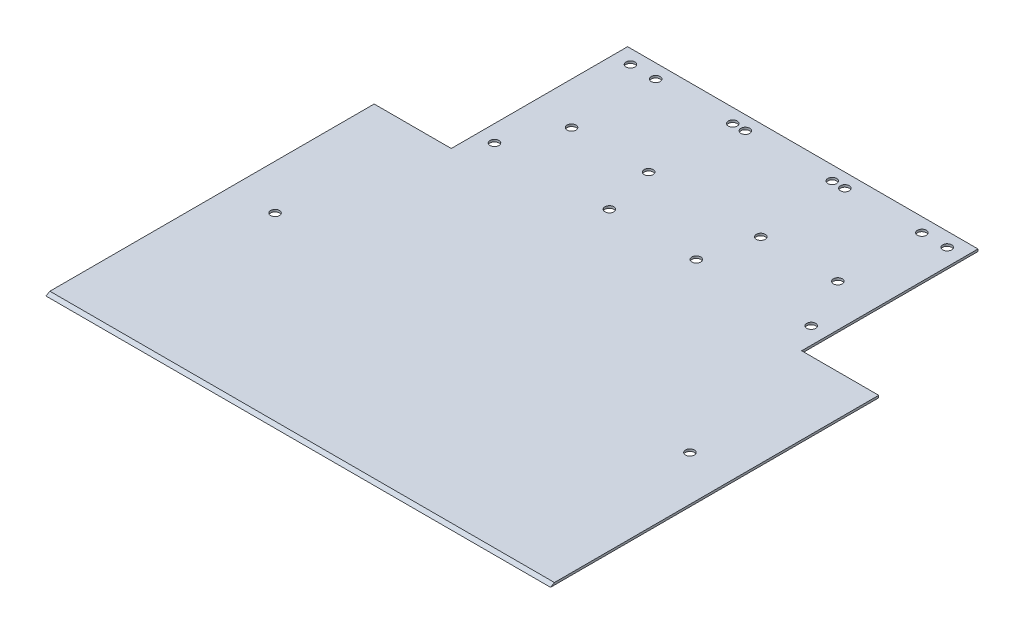
ISO-10303-21;
HEADER;
FILE_DESCRIPTION(('STEP AP214'),'2;1');
FILE_NAME('part.step','',(''),(''),'','','');
FILE_SCHEMA(('AUTOMOTIVE_DESIGN { 1 0 10303 214 1 1 1 1 }'));
ENDSEC;
DATA;
#1=APPLICATION_CONTEXT('core data for automotive mechanical design processes');
#2=APPLICATION_PROTOCOL_DEFINITION('international standard','automotive_design',2000,#1);
#3=PRODUCT_CONTEXT('',#1,'mechanical');
#4=PRODUCT('Part','Part','',(#3));
#5=PRODUCT_RELATED_PRODUCT_CATEGORY('part','',(#4));
#6=PRODUCT_DEFINITION_FORMATION('','',#4);
#7=PRODUCT_DEFINITION_CONTEXT('part definition',#1,'design');
#8=PRODUCT_DEFINITION('design','',#6,#7);
#9=PRODUCT_DEFINITION_SHAPE('','',#8);
#10=(LENGTH_UNIT() NAMED_UNIT(*) SI_UNIT(.MILLI.,.METRE.));
#11=(NAMED_UNIT(*) PLANE_ANGLE_UNIT() SI_UNIT($,.RADIAN.));
#12=(NAMED_UNIT(*) SI_UNIT($,.STERADIAN.) SOLID_ANGLE_UNIT());
#13=UNCERTAINTY_MEASURE_WITH_UNIT(LENGTH_MEASURE(1.E-05),#10,'distance_accuracy_value','');
#14=(GEOMETRIC_REPRESENTATION_CONTEXT(3) GLOBAL_UNCERTAINTY_ASSIGNED_CONTEXT((#13)) GLOBAL_UNIT_ASSIGNED_CONTEXT((#10,
#11,#12)) REPRESENTATION_CONTEXT('',''));
#15=CARTESIAN_POINT('',(0.,0.,0.));
#16=DIRECTION('',(0.,0.,1.));
#17=DIRECTION('',(1.,0.,0.));
#18=AXIS2_PLACEMENT_3D('',#15,#16,#17);
#19=CARTESIAN_POINT('',(90.,0.8,90.));
#20=DIRECTION('',(-1.,0.,0.));
#21=DIRECTION('',(0.,0.,1.));
#22=AXIS2_PLACEMENT_3D('',#19,#20,#21);
#23=PLANE('',#22);
#24=DIRECTION('',(0.,0.,-1.));
#25=VECTOR('',#24,1.);
#26=CARTESIAN_POINT('',(90.,0.8,90.));
#27=LINE('',#26,#25);
#28=CARTESIAN_POINT('',(90.,0.8,88.614359353945));
#29=VERTEX_POINT('',#28);
#30=CARTESIAN_POINT('',(90.,0.8,-27.08));
#31=VERTEX_POINT('',#30);
#32=EDGE_CURVE('E106',#29,#31,#27,.T.);
#33=ORIENTED_EDGE('',*,*,#32,.F.);
#34=DIRECTION('',(0.,0.500000000000006,-0.866025403784435));
#35=VECTOR('',#34,1.);
#36=CARTESIAN_POINT('',(90.,0.,90.0000000000001));
#37=LINE('',#36,#35);
#38=CARTESIAN_POINT('',(90.,0.,90.0000000000001));
#39=VERTEX_POINT('',#38);
#40=EDGE_CURVE('E183',#39,#29,#37,.T.);
#41=ORIENTED_EDGE('',*,*,#40,.F.);
#42=DIRECTION('',(0.,0.,-1.));
#43=VECTOR('',#42,1.);
#44=CARTESIAN_POINT('',(90.,0.,90.));
#45=LINE('',#44,#43);
#46=CARTESIAN_POINT('',(90.,0.,-27.08));
#47=VERTEX_POINT('',#46);
#48=EDGE_CURVE('E146',#39,#47,#45,.T.);
#49=ORIENTED_EDGE('',*,*,#48,.T.);
#50=DIRECTION('',(0.,-1.,0.));
#51=VECTOR('',#50,1.);
#52=CARTESIAN_POINT('',(90.,0.8,-27.08));
#53=LINE('',#52,#51);
#54=EDGE_CURVE('E11',#31,#47,#53,.T.);
#55=ORIENTED_EDGE('',*,*,#54,.F.);
#56=EDGE_LOOP('',(#33,#41,#49,#55));
#57=FACE_BOUND('',#56,.T.);
#58=ADVANCED_FACE('F48',(#57),#23,.F.);
#59=CARTESIAN_POINT('',(62.5,0.8,-27.08));
#60=DIRECTION('',(0.,0.,1.));
#61=DIRECTION('',(1.,0.,0.));
#62=AXIS2_PLACEMENT_3D('',#59,#60,#61);
#63=PLANE('',#62);
#64=DIRECTION('',(-1.,0.,0.));
#65=VECTOR('',#64,1.);
#66=CARTESIAN_POINT('',(62.5,0.,-27.08));
#67=LINE('',#66,#65);
#68=CARTESIAN_POINT('',(62.5,0.,-27.08));
#69=VERTEX_POINT('',#68);
#70=EDGE_CURVE('E149',#47,#69,#67,.T.);
#71=ORIENTED_EDGE('',*,*,#70,.T.);
#72=DIRECTION('',(0.,-1.,0.));
#73=VECTOR('',#72,1.);
#74=CARTESIAN_POINT('',(62.5,0.8,-27.08));
#75=LINE('',#74,#73);
#76=CARTESIAN_POINT('',(62.5,0.8,-27.08));
#77=VERTEX_POINT('',#76);
#78=EDGE_CURVE('E56',#77,#69,#75,.T.);
#79=ORIENTED_EDGE('',*,*,#78,.F.);
#80=DIRECTION('',(-1.,0.,0.));
#81=VECTOR('',#80,1.);
#82=CARTESIAN_POINT('',(62.5,0.8,-27.08));
#83=LINE('',#82,#81);
#84=EDGE_CURVE('E198',#31,#77,#83,.T.);
#85=ORIENTED_EDGE('',*,*,#84,.F.);
#86=ORIENTED_EDGE('',*,*,#54,.T.);
#87=EDGE_LOOP('',(#71,#79,#85,#86));
#88=FACE_BOUND('',#87,.T.);
#89=ADVANCED_FACE('F199',(#88),#63,.F.);
#90=CARTESIAN_POINT('',(62.5,0.8,-90.));
#91=DIRECTION('',(-1.,0.,0.));
#92=DIRECTION('',(0.,0.,1.));
#93=AXIS2_PLACEMENT_3D('',#90,#91,#92);
#94=PLANE('',#93);
#95=DIRECTION('',(0.,0.,-1.));
#96=VECTOR('',#95,1.);
#97=CARTESIAN_POINT('',(62.5,0.,-90.));
#98=LINE('',#97,#96);
#99=CARTESIAN_POINT('',(62.5,0.,-90.));
#100=VERTEX_POINT('',#99);
#101=EDGE_CURVE('E152',#69,#100,#98,.T.);
#102=ORIENTED_EDGE('',*,*,#101,.T.);
#103=DIRECTION('',(0.,-1.,0.));
#104=VECTOR('',#103,1.);
#105=CARTESIAN_POINT('',(62.5,0.8,-90.));
#106=LINE('',#105,#104);
#107=CARTESIAN_POINT('',(62.5,0.8,-90.));
#108=VERTEX_POINT('',#107);
#109=EDGE_CURVE('E135',#108,#100,#106,.T.);
#110=ORIENTED_EDGE('',*,*,#109,.F.);
#111=DIRECTION('',(0.,0.,-1.));
#112=VECTOR('',#111,1.);
#113=CARTESIAN_POINT('',(62.5,0.8,-90.));
#114=LINE('',#113,#112);
#115=EDGE_CURVE('E123',#77,#108,#114,.T.);
#116=ORIENTED_EDGE('',*,*,#115,.F.);
#117=ORIENTED_EDGE('',*,*,#78,.T.);
#118=EDGE_LOOP('',(#102,#110,#116,#117));
#119=FACE_BOUND('',#118,.T.);
#120=ADVANCED_FACE('F168',(#119),#94,.F.);
#121=CARTESIAN_POINT('',(62.5,0.8,-90.));
#122=DIRECTION('',(0.,0.,1.));
#123=DIRECTION('',(1.,0.,0.));
#124=AXIS2_PLACEMENT_3D('',#121,#122,#123);
#125=PLANE('',#124);
#126=DIRECTION('',(-1.,0.,0.));
#127=VECTOR('',#126,1.);
#128=CARTESIAN_POINT('',(62.5,0.,-90.));
#129=LINE('',#128,#127);
#130=CARTESIAN_POINT('',(-62.5,0.,-90.));
#131=VERTEX_POINT('',#130);
#132=EDGE_CURVE('E132',#100,#131,#129,.T.);
#133=ORIENTED_EDGE('',*,*,#132,.T.);
#134=DIRECTION('',(0.,-1.,0.));
#135=VECTOR('',#134,1.);
#136=CARTESIAN_POINT('',(-62.5,0.8,-90.));
#137=LINE('',#136,#135);
#138=CARTESIAN_POINT('',(-62.5,0.8,-90.));
#139=VERTEX_POINT('',#138);
#140=EDGE_CURVE('E129',#139,#131,#137,.T.);
#141=ORIENTED_EDGE('',*,*,#140,.F.);
#142=DIRECTION('',(-1.,0.,0.));
#143=VECTOR('',#142,1.);
#144=CARTESIAN_POINT('',(62.5,0.8,-90.));
#145=LINE('',#144,#143);
#146=EDGE_CURVE('E116',#108,#139,#145,.T.);
#147=ORIENTED_EDGE('',*,*,#146,.F.);
#148=ORIENTED_EDGE('',*,*,#109,.T.);
#149=EDGE_LOOP('',(#133,#141,#147,#148));
#150=FACE_BOUND('',#149,.T.);
#151=ADVANCED_FACE('F130',(#150),#125,.F.);
#152=CARTESIAN_POINT('',(-62.5,0.8,-90.));
#153=DIRECTION('',(1.,0.,0.));
#154=DIRECTION('',(0.,0.,-1.));
#155=AXIS2_PLACEMENT_3D('',#152,#153,#154);
#156=PLANE('',#155);
#157=DIRECTION('',(0.,0.,1.));
#158=VECTOR('',#157,1.);
#159=CARTESIAN_POINT('',(-62.5,0.,-90.));
#160=LINE('',#159,#158);
#161=CARTESIAN_POINT('',(-62.5,0.,-27.08));
#162=VERTEX_POINT('',#161);
#163=EDGE_CURVE('E155',#131,#162,#160,.T.);
#164=ORIENTED_EDGE('',*,*,#163,.T.);
#165=DIRECTION('',(0.,-1.,0.));
#166=VECTOR('',#165,1.);
#167=CARTESIAN_POINT('',(-62.5,0.8,-27.08));
#168=LINE('',#167,#166);
#169=CARTESIAN_POINT('',(-62.5,0.8,-27.08));
#170=VERTEX_POINT('',#169);
#171=EDGE_CURVE('E136',#170,#162,#168,.T.);
#172=ORIENTED_EDGE('',*,*,#171,.F.);
#173=DIRECTION('',(0.,0.,1.));
#174=VECTOR('',#173,1.);
#175=CARTESIAN_POINT('',(-62.5,0.8,-90.));
#176=LINE('',#175,#174);
#177=EDGE_CURVE('E120',#139,#170,#176,.T.);
#178=ORIENTED_EDGE('',*,*,#177,.F.);
#179=ORIENTED_EDGE('',*,*,#140,.T.);
#180=EDGE_LOOP('',(#164,#172,#178,#179));
#181=FACE_BOUND('',#180,.T.);
#182=ADVANCED_FACE('F138',(#181),#156,.F.);
#183=CARTESIAN_POINT('',(-62.5,0.8,-27.08));
#184=DIRECTION('',(0.,0.,1.));
#185=DIRECTION('',(1.,0.,0.));
#186=AXIS2_PLACEMENT_3D('',#183,#184,#185);
#187=PLANE('',#186);
#188=DIRECTION('',(-1.,0.,0.));
#189=VECTOR('',#188,1.);
#190=CARTESIAN_POINT('',(-62.5,0.,-27.08));
#191=LINE('',#190,#189);
#192=CARTESIAN_POINT('',(-90.,0.,-27.08));
#193=VERTEX_POINT('',#192);
#194=EDGE_CURVE('E90',#162,#193,#191,.T.);
#195=ORIENTED_EDGE('',*,*,#194,.T.);
#196=DIRECTION('',(0.,-1.,0.));
#197=VECTOR('',#196,1.);
#198=CARTESIAN_POINT('',(-90.,0.8,-27.08));
#199=LINE('',#198,#197);
#200=CARTESIAN_POINT('',(-90.,0.8,-27.08));
#201=VERTEX_POINT('',#200);
#202=EDGE_CURVE('E145',#201,#193,#199,.T.);
#203=ORIENTED_EDGE('',*,*,#202,.F.);
#204=DIRECTION('',(-1.,0.,0.));
#205=VECTOR('',#204,1.);
#206=CARTESIAN_POINT('',(-62.5,0.8,-27.08));
#207=LINE('',#206,#205);
#208=EDGE_CURVE('E64',#170,#201,#207,.T.);
#209=ORIENTED_EDGE('',*,*,#208,.F.);
#210=ORIENTED_EDGE('',*,*,#171,.T.);
#211=EDGE_LOOP('',(#195,#203,#209,#210));
#212=FACE_BOUND('',#211,.T.);
#213=ADVANCED_FACE('F174',(#212),#187,.F.);
#214=CARTESIAN_POINT('',(-90.,0.8,90.));
#215=DIRECTION('',(1.,0.,0.));
#216=DIRECTION('',(0.,0.,-1.));
#217=AXIS2_PLACEMENT_3D('',#214,#215,#216);
#218=PLANE('',#217);
#219=DIRECTION('',(0.,0.,1.));
#220=VECTOR('',#219,1.);
#221=CARTESIAN_POINT('',(-90.,0.,90.));
#222=LINE('',#221,#220);
#223=CARTESIAN_POINT('',(-90.,0.,90.));
#224=VERTEX_POINT('',#223);
#225=EDGE_CURVE('E158',#193,#224,#222,.T.);
#226=ORIENTED_EDGE('',*,*,#225,.T.);
#227=DIRECTION('',(0.,-0.500000000000006,0.866025403784435));
#228=VECTOR('',#227,1.);
#229=CARTESIAN_POINT('',(-90.,0.,90.));
#230=LINE('',#229,#228);
#231=CARTESIAN_POINT('',(-90.,0.8,88.6143593539449));
#232=VERTEX_POINT('',#231);
#233=EDGE_CURVE('E98',#232,#224,#230,.T.);
#234=ORIENTED_EDGE('',*,*,#233,.F.);
#235=DIRECTION('',(0.,0.,1.));
#236=VECTOR('',#235,1.);
#237=CARTESIAN_POINT('',(-90.,0.8,90.));
#238=LINE('',#237,#236);
#239=EDGE_CURVE('E140',#201,#232,#238,.T.);
#240=ORIENTED_EDGE('',*,*,#239,.F.);
#241=ORIENTED_EDGE('',*,*,#202,.T.);
#242=EDGE_LOOP('',(#226,#234,#240,#241));
#243=FACE_BOUND('',#242,.T.);
#244=ADVANCED_FACE('F177',(#243),#218,.F.);
#245=CARTESIAN_POINT('',(0.,0.8,0.));
#246=DIRECTION('',(0.,-1.,0.));
#247=DIRECTION('',(0.,0.,-1.));
#248=AXIS2_PLACEMENT_3D('',#245,#246,#247);
#249=PLANE('',#248);
#250=CARTESIAN_POINT('',(20.,0.8,-55.005640646055));
#251=DIRECTION('',(0.,-1.,0.));
#252=DIRECTION('',(0.,0.,1.));
#253=AXIS2_PLACEMENT_3D('',#250,#251,#252);
#254=CIRCLE('',#253,1.58499999999999);
#255=CARTESIAN_POINT('',(20.,0.8,-53.420640646055));
#256=VERTEX_POINT('',#255);
#257=EDGE_CURVE('E315',#256,#256,#254,.T.);
#258=ORIENTED_EDGE('',*,*,#257,.T.);
#259=EDGE_LOOP('',(#258));
#260=FACE_BOUND('',#259,.T.);
#261=CARTESIAN_POINT('',(47.5,0.8,-55.0056406460554));
#262=DIRECTION('',(0.,-1.,0.));
#263=DIRECTION('',(0.,0.,1.));
#264=AXIS2_PLACEMENT_3D('',#261,#262,#263);
#265=CIRCLE('',#264,1.58499999999999);
#266=CARTESIAN_POINT('',(47.5,0.8,-53.4206406460554));
#267=VERTEX_POINT('',#266);
#268=EDGE_CURVE('E309',#267,#267,#265,.T.);
#269=ORIENTED_EDGE('',*,*,#268,.T.);
#270=EDGE_LOOP('',(#269));
#271=FACE_BOUND('',#270,.T.);
#272=CARTESIAN_POINT('',(47.5,0.8,-85.0056406460548));
#273=DIRECTION('',(0.,-1.,0.));
#274=DIRECTION('',(0.,0.,1.));
#275=AXIS2_PLACEMENT_3D('',#272,#273,#274);
#276=CIRCLE('',#275,1.58499999999999);
#277=CARTESIAN_POINT('',(47.5,0.8,-83.4206406460548));
#278=VERTEX_POINT('',#277);
#279=EDGE_CURVE('E302',#278,#278,#276,.T.);
#280=ORIENTED_EDGE('',*,*,#279,.T.);
#281=EDGE_LOOP('',(#280));
#282=FACE_BOUND('',#281,.T.);
#283=CARTESIAN_POINT('',(20.,0.8,-85.0056406460553));
#284=DIRECTION('',(0.,-1.,0.));
#285=DIRECTION('',(0.,0.,1.));
#286=AXIS2_PLACEMENT_3D('',#283,#284,#285);
#287=CIRCLE('',#286,1.58499999999999);
#288=CARTESIAN_POINT('',(20.,0.8,-83.4206406460553));
#289=VERTEX_POINT('',#288);
#290=EDGE_CURVE('E306',#289,#289,#287,.T.);
#291=ORIENTED_EDGE('',*,*,#290,.T.);
#292=EDGE_LOOP('',(#291));
#293=FACE_BOUND('',#292,.T.);
#294=CARTESIAN_POINT('',(-20.,0.8,-55.005640646055));
#295=DIRECTION('',(0.,1.,0.));
#296=DIRECTION('',(0.,0.,1.));
#297=AXIS2_PLACEMENT_3D('',#294,#295,#296);
#298=CIRCLE('',#297,1.58499999999999);
#299=CARTESIAN_POINT('',(-20.,0.8,-53.420640646055));
#300=VERTEX_POINT('',#299);
#301=EDGE_CURVE('E325',#300,#300,#298,.T.);
#302=ORIENTED_EDGE('',*,*,#301,.F.);
#303=EDGE_LOOP('',(#302));
#304=FACE_BOUND('',#303,.T.);
#305=CARTESIAN_POINT('',(-47.5,0.8,-55.0056406460554));
#306=DIRECTION('',(0.,1.,0.));
#307=DIRECTION('',(0.,0.,1.));
#308=AXIS2_PLACEMENT_3D('',#305,#306,#307);
#309=CIRCLE('',#308,1.58499999999999);
#310=CARTESIAN_POINT('',(-47.5,0.8,-53.4206406460554));
#311=VERTEX_POINT('',#310);
#312=EDGE_CURVE('E336',#311,#311,#309,.T.);
#313=ORIENTED_EDGE('',*,*,#312,.F.);
#314=EDGE_LOOP('',(#313));
#315=FACE_BOUND('',#314,.T.);
#316=CARTESIAN_POINT('',(-47.5,0.8,-85.0056406460548));
#317=DIRECTION('',(0.,1.,0.));
#318=DIRECTION('',(0.,0.,1.));
#319=AXIS2_PLACEMENT_3D('',#316,#317,#318);
#320=CIRCLE('',#319,1.58499999999999);
#321=CARTESIAN_POINT('',(-47.5,0.8,-83.4206406460548));
#322=VERTEX_POINT('',#321);
#323=EDGE_CURVE('E330',#322,#322,#320,.T.);
#324=ORIENTED_EDGE('',*,*,#323,.F.);
#325=EDGE_LOOP('',(#324));
#326=FACE_BOUND('',#325,.T.);
#327=CARTESIAN_POINT('',(-20.,0.8,-85.0056406460553));
#328=DIRECTION('',(0.,1.,0.));
#329=DIRECTION('',(0.,0.,1.));
#330=AXIS2_PLACEMENT_3D('',#327,#328,#329);
#331=CIRCLE('',#330,1.58499999999999);
#332=CARTESIAN_POINT('',(-20.,0.8,-83.4206406460553));
#333=VERTEX_POINT('',#332);
#334=EDGE_CURVE('E344',#333,#333,#331,.T.);
#335=ORIENTED_EDGE('',*,*,#334,.F.);
#336=EDGE_LOOP('',(#335));
#337=FACE_BOUND('',#336,.T.);
#338=CARTESIAN_POINT('',(56.5,0.8,-36.5056406460551));
#339=DIRECTION('',(0.,1.,0.));
#340=DIRECTION('',(0.,0.,1.));
#341=AXIS2_PLACEMENT_3D('',#338,#339,#340);
#342=CIRCLE('',#341,1.58499999999999);
#343=CARTESIAN_POINT('',(56.5,0.8,-34.9206406460551));
#344=VERTEX_POINT('',#343);
#345=EDGE_CURVE('E347',#344,#344,#342,.T.);
#346=ORIENTED_EDGE('',*,*,#345,.F.);
#347=EDGE_LOOP('',(#346));
#348=FACE_BOUND('',#347,.T.);
#349=CARTESIAN_POINT('',(15.5,0.8,-36.5056406460551));
#350=DIRECTION('',(0.,1.,0.));
#351=DIRECTION('',(0.,0.,1.));
#352=AXIS2_PLACEMENT_3D('',#349,#350,#351);
#353=CIRCLE('',#352,1.58499999999999);
#354=CARTESIAN_POINT('',(15.5,0.8,-34.9206406460551));
#355=VERTEX_POINT('',#354);
#356=EDGE_CURVE('E360',#355,#355,#353,.T.);
#357=ORIENTED_EDGE('',*,*,#356,.F.);
#358=EDGE_LOOP('',(#357));
#359=FACE_BOUND('',#358,.T.);
#360=CARTESIAN_POINT('',(15.5,0.8,-85.0056406460551));
#361=DIRECTION('',(0.,1.,0.));
#362=DIRECTION('',(0.,0.,1.));
#363=AXIS2_PLACEMENT_3D('',#360,#361,#362);
#364=CIRCLE('',#363,1.58499999999999);
#365=CARTESIAN_POINT('',(15.5,0.8,-83.4206406460551));
#366=VERTEX_POINT('',#365);
#367=EDGE_CURVE('E354',#366,#366,#364,.T.);
#368=ORIENTED_EDGE('',*,*,#367,.F.);
#369=EDGE_LOOP('',(#368));
#370=FACE_BOUND('',#369,.T.);
#371=CARTESIAN_POINT('',(56.5,0.8,-85.0056406460551));
#372=DIRECTION('',(0.,1.,0.));
#373=DIRECTION('',(0.,0.,1.));
#374=AXIS2_PLACEMENT_3D('',#371,#372,#373);
#375=CIRCLE('',#374,1.58499999999999);
#376=CARTESIAN_POINT('',(56.5,0.8,-83.4206406460551));
#377=VERTEX_POINT('',#376);
#378=EDGE_CURVE('E368',#377,#377,#375,.T.);
#379=ORIENTED_EDGE('',*,*,#378,.F.);
#380=EDGE_LOOP('',(#379));
#381=FACE_BOUND('',#380,.T.);
#382=CARTESIAN_POINT('',(-56.5,0.8,-85.0056406460551));
#383=DIRECTION('',(0.,1.,0.));
#384=DIRECTION('',(0.,0.,1.));
#385=AXIS2_PLACEMENT_3D('',#382,#383,#384);
#386=CIRCLE('',#385,1.58499999999899);
#387=CARTESIAN_POINT('',(-56.5,0.8,-83.4206406460561));
#388=VERTEX_POINT('',#387);
#389=EDGE_CURVE('E371',#388,#388,#386,.T.);
#390=ORIENTED_EDGE('',*,*,#389,.F.);
#391=EDGE_LOOP('',(#390));
#392=FACE_BOUND('',#391,.T.);
#393=CARTESIAN_POINT('',(-15.5000000000009,0.8,-85.0056406460553));
#394=DIRECTION('',(0.,1.,0.));
#395=DIRECTION('',(0.,0.,1.));
#396=AXIS2_PLACEMENT_3D('',#393,#394,#395);
#397=CIRCLE('',#396,1.58499999999999);
#398=CARTESIAN_POINT('',(-15.5000000000009,0.8,-83.4206406460553));
#399=VERTEX_POINT('',#398);
#400=EDGE_CURVE('E384',#399,#399,#397,.T.);
#401=ORIENTED_EDGE('',*,*,#400,.F.);
#402=EDGE_LOOP('',(#401));
#403=FACE_BOUND('',#402,.T.);
#404=CARTESIAN_POINT('',(-15.5,0.8,-36.5056406460551));
#405=DIRECTION('',(0.,1.,0.));
#406=DIRECTION('',(0.,0.,1.));
#407=AXIS2_PLACEMENT_3D('',#404,#405,#406);
#408=CIRCLE('',#407,1.58499999999962);
#409=CARTESIAN_POINT('',(-15.5,0.8,-34.9206406460555));
#410=VERTEX_POINT('',#409);
#411=EDGE_CURVE('E378',#410,#410,#408,.T.);
#412=ORIENTED_EDGE('',*,*,#411,.F.);
#413=EDGE_LOOP('',(#412));
#414=FACE_BOUND('',#413,.T.);
#415=CARTESIAN_POINT('',(-56.5000000000004,0.8,-36.5056406460548));
#416=DIRECTION('',(0.,1.,0.));
#417=DIRECTION('',(0.,0.,1.));
#418=AXIS2_PLACEMENT_3D('',#415,#416,#417);
#419=CIRCLE('',#418,1.585);
#420=CARTESIAN_POINT('',(-56.5000000000004,0.8,-34.9206406460548));
#421=VERTEX_POINT('',#420);
#422=EDGE_CURVE('E392',#421,#421,#419,.T.);
#423=ORIENTED_EDGE('',*,*,#422,.F.);
#424=EDGE_LOOP('',(#423));
#425=FACE_BOUND('',#424,.T.);
#426=CARTESIAN_POINT('',(-74.,0.8,24.2793399367234));
#427=DIRECTION('',(0.,-1.,0.));
#428=DIRECTION('',(0.,0.,1.));
#429=AXIS2_PLACEMENT_3D('',#426,#427,#428);
#430=CIRCLE('',#429,1.58499999999999);
#431=CARTESIAN_POINT('',(-74.,0.8,25.8643399367234));
#432=VERTEX_POINT('',#431);
#433=EDGE_CURVE('E395',#432,#432,#430,.T.);
#434=ORIENTED_EDGE('',*,*,#433,.T.);
#435=EDGE_LOOP('',(#434));
#436=FACE_BOUND('',#435,.T.);
#437=CARTESIAN_POINT('',(74.,0.8,24.2793399367234));
#438=DIRECTION('',(0.,1.,0.));
#439=DIRECTION('',(0.,0.,1.));
#440=AXIS2_PLACEMENT_3D('',#437,#438,#439);
#441=CIRCLE('',#440,1.58499999999999);
#442=CARTESIAN_POINT('',(74.,0.8,25.8643399367234));
#443=VERTEX_POINT('',#442);
#444=EDGE_CURVE('E188',#443,#443,#441,.T.);
#445=ORIENTED_EDGE('',*,*,#444,.F.);
#446=EDGE_LOOP('',(#445));
#447=FACE_BOUND('',#446,.T.);
#448=ORIENTED_EDGE('',*,*,#239,.T.);
#449=DIRECTION('',(-1.,0.,0.));
#450=VECTOR('',#449,1.);
#451=CARTESIAN_POINT('',(90.001,0.8,88.614359353945));
#452=LINE('',#451,#450);
#453=EDGE_CURVE('E150',#29,#232,#452,.T.);
#454=ORIENTED_EDGE('',*,*,#453,.F.);
#455=ORIENTED_EDGE('',*,*,#32,.T.);
#456=ORIENTED_EDGE('',*,*,#84,.T.);
#457=ORIENTED_EDGE('',*,*,#115,.T.);
#458=ORIENTED_EDGE('',*,*,#146,.T.);
#459=ORIENTED_EDGE('',*,*,#177,.T.);
#460=ORIENTED_EDGE('',*,*,#208,.T.);
#461=EDGE_LOOP('',(#448,#454,#455,#456,#457,#458,#459,#460));
#462=FACE_BOUND('',#461,.T.);
#463=ADVANCED_FACE('F118',(#260,#271,#282,#293,#304,#315,#326,#337,#348,#359,#370,#381,#392,
#403,#414,#425,#436,#447,#462),#249,.F.);
#464=CARTESIAN_POINT('',(0.,0.,0.));
#465=DIRECTION('',(0.,-1.,0.));
#466=DIRECTION('',(0.,0.,-1.));
#467=AXIS2_PLACEMENT_3D('',#464,#465,#466);
#468=PLANE('',#467);
#469=CARTESIAN_POINT('',(20.,0.,-55.005640646055));
#470=DIRECTION('',(0.,-1.,0.));
#471=DIRECTION('',(0.,0.,-1.));
#472=AXIS2_PLACEMENT_3D('',#469,#470,#471);
#473=CIRCLE('',#472,1.58499999999999);
#474=CARTESIAN_POINT('',(20.,0.,-56.590640646055));
#475=VERTEX_POINT('',#474);
#476=EDGE_CURVE('E313',#475,#475,#473,.T.);
#477=ORIENTED_EDGE('',*,*,#476,.F.);
#478=EDGE_LOOP('',(#477));
#479=FACE_BOUND('',#478,.T.);
#480=CARTESIAN_POINT('',(47.5,0.,-55.0056406460554));
#481=DIRECTION('',(0.,-1.,0.));
#482=DIRECTION('',(0.,0.,-1.));
#483=AXIS2_PLACEMENT_3D('',#480,#481,#482);
#484=CIRCLE('',#483,1.58499999999999);
#485=CARTESIAN_POINT('',(47.5,0.,-56.5906406460554));
#486=VERTEX_POINT('',#485);
#487=EDGE_CURVE('E304',#486,#486,#484,.T.);
#488=ORIENTED_EDGE('',*,*,#487,.F.);
#489=EDGE_LOOP('',(#488));
#490=FACE_BOUND('',#489,.T.);
#491=CARTESIAN_POINT('',(47.5,0.,-85.0056406460548));
#492=DIRECTION('',(0.,-1.,0.));
#493=DIRECTION('',(0.,0.,-1.));
#494=AXIS2_PLACEMENT_3D('',#491,#492,#493);
#495=CIRCLE('',#494,1.58499999999999);
#496=CARTESIAN_POINT('',(47.5,0.,-86.5906406460548));
#497=VERTEX_POINT('',#496);
#498=EDGE_CURVE('E299',#497,#497,#495,.T.);
#499=ORIENTED_EDGE('',*,*,#498,.F.);
#500=EDGE_LOOP('',(#499));
#501=FACE_BOUND('',#500,.T.);
#502=CARTESIAN_POINT('',(20.,0.,-85.0056406460553));
#503=DIRECTION('',(0.,-1.,0.));
#504=DIRECTION('',(0.,0.,-1.));
#505=AXIS2_PLACEMENT_3D('',#502,#503,#504);
#506=CIRCLE('',#505,1.58499999999999);
#507=CARTESIAN_POINT('',(20.,0.,-86.5906406460552));
#508=VERTEX_POINT('',#507);
#509=EDGE_CURVE('E322',#508,#508,#506,.T.);
#510=ORIENTED_EDGE('',*,*,#509,.F.);
#511=EDGE_LOOP('',(#510));
#512=FACE_BOUND('',#511,.T.);
#513=CARTESIAN_POINT('',(-20.,0.,-55.005640646055));
#514=DIRECTION('',(0.,-1.,0.));
#515=DIRECTION('',(0.,0.,-1.));
#516=AXIS2_PLACEMENT_3D('',#513,#514,#515);
#517=CIRCLE('',#516,1.58499999999999);
#518=CARTESIAN_POINT('',(-20.,0.,-56.590640646055));
#519=VERTEX_POINT('',#518);
#520=EDGE_CURVE('E339',#519,#519,#517,.F.);
#521=ORIENTED_EDGE('',*,*,#520,.T.);
#522=EDGE_LOOP('',(#521));
#523=FACE_BOUND('',#522,.T.);
#524=CARTESIAN_POINT('',(-47.5,0.,-55.0056406460554));
#525=DIRECTION('',(0.,-1.,0.));
#526=DIRECTION('',(0.,0.,-1.));
#527=AXIS2_PLACEMENT_3D('',#524,#525,#526);
#528=CIRCLE('',#527,1.58499999999999);
#529=CARTESIAN_POINT('',(-47.5,0.,-56.5906406460554));
#530=VERTEX_POINT('',#529);
#531=EDGE_CURVE('E333',#530,#530,#528,.F.);
#532=ORIENTED_EDGE('',*,*,#531,.T.);
#533=EDGE_LOOP('',(#532));
#534=FACE_BOUND('',#533,.T.);
#535=CARTESIAN_POINT('',(-47.5,0.,-85.0056406460548));
#536=DIRECTION('',(0.,-1.,0.));
#537=DIRECTION('',(0.,0.,-1.));
#538=AXIS2_PLACEMENT_3D('',#535,#536,#537);
#539=CIRCLE('',#538,1.58499999999999);
#540=CARTESIAN_POINT('',(-47.5,0.,-86.5906406460548));
#541=VERTEX_POINT('',#540);
#542=EDGE_CURVE('E326',#541,#541,#539,.F.);
#543=ORIENTED_EDGE('',*,*,#542,.T.);
#544=EDGE_LOOP('',(#543));
#545=FACE_BOUND('',#544,.T.);
#546=CARTESIAN_POINT('',(-20.,0.,-85.0056406460553));
#547=DIRECTION('',(0.,-1.,0.));
#548=DIRECTION('',(0.,0.,-1.));
#549=AXIS2_PLACEMENT_3D('',#546,#547,#548);
#550=CIRCLE('',#549,1.58499999999999);
#551=CARTESIAN_POINT('',(-20.,0.,-86.5906406460552));
#552=VERTEX_POINT('',#551);
#553=EDGE_CURVE('E329',#552,#552,#550,.F.);
#554=ORIENTED_EDGE('',*,*,#553,.T.);
#555=EDGE_LOOP('',(#554));
#556=FACE_BOUND('',#555,.T.);
#557=CARTESIAN_POINT('',(56.5,0.,-36.5056406460551));
#558=DIRECTION('',(0.,-1.,0.));
#559=DIRECTION('',(0.,0.,-1.));
#560=AXIS2_PLACEMENT_3D('',#557,#558,#559);
#561=CIRCLE('',#560,1.58499999999999);
#562=CARTESIAN_POINT('',(56.5,0.,-38.0906406460551));
#563=VERTEX_POINT('',#562);
#564=EDGE_CURVE('E363',#563,#563,#561,.F.);
#565=ORIENTED_EDGE('',*,*,#564,.T.);
#566=EDGE_LOOP('',(#565));
#567=FACE_BOUND('',#566,.T.);
#568=CARTESIAN_POINT('',(15.5,0.,-36.5056406460551));
#569=DIRECTION('',(0.,-1.,0.));
#570=DIRECTION('',(0.,0.,-1.));
#571=AXIS2_PLACEMENT_3D('',#568,#569,#570);
#572=CIRCLE('',#571,1.58499999999999);
#573=CARTESIAN_POINT('',(15.5,0.,-38.0906406460551));
#574=VERTEX_POINT('',#573);
#575=EDGE_CURVE('E357',#574,#574,#572,.F.);
#576=ORIENTED_EDGE('',*,*,#575,.T.);
#577=EDGE_LOOP('',(#576));
#578=FACE_BOUND('',#577,.T.);
#579=CARTESIAN_POINT('',(15.5,0.,-85.0056406460551));
#580=DIRECTION('',(0.,-1.,0.));
#581=DIRECTION('',(0.,0.,-1.));
#582=AXIS2_PLACEMENT_3D('',#579,#580,#581);
#583=CIRCLE('',#582,1.58499999999999);
#584=CARTESIAN_POINT('',(15.5,0.,-86.5906406460551));
#585=VERTEX_POINT('',#584);
#586=EDGE_CURVE('E350',#585,#585,#583,.F.);
#587=ORIENTED_EDGE('',*,*,#586,.T.);
#588=EDGE_LOOP('',(#587));
#589=FACE_BOUND('',#588,.T.);
#590=CARTESIAN_POINT('',(56.5,0.,-85.0056406460551));
#591=DIRECTION('',(0.,-1.,0.));
#592=DIRECTION('',(0.,0.,-1.));
#593=AXIS2_PLACEMENT_3D('',#590,#591,#592);
#594=CIRCLE('',#593,1.58499999999999);
#595=CARTESIAN_POINT('',(56.5,0.,-86.5906406460551));
#596=VERTEX_POINT('',#595);
#597=EDGE_CURVE('E353',#596,#596,#594,.F.);
#598=ORIENTED_EDGE('',*,*,#597,.T.);
#599=EDGE_LOOP('',(#598));
#600=FACE_BOUND('',#599,.T.);
#601=CARTESIAN_POINT('',(-56.5,0.,-85.0056406460551));
#602=DIRECTION('',(0.,-1.,0.));
#603=DIRECTION('',(0.,0.,-1.));
#604=AXIS2_PLACEMENT_3D('',#601,#602,#603);
#605=CIRCLE('',#604,1.58499999999899);
#606=CARTESIAN_POINT('',(-56.5,0.,-86.5906406460541));
#607=VERTEX_POINT('',#606);
#608=EDGE_CURVE('E387',#607,#607,#605,.F.);
#609=ORIENTED_EDGE('',*,*,#608,.T.);
#610=EDGE_LOOP('',(#609));
#611=FACE_BOUND('',#610,.T.);
#612=CARTESIAN_POINT('',(-15.5000000000009,0.,-85.0056406460553));
#613=DIRECTION('',(0.,-1.,0.));
#614=DIRECTION('',(0.,0.,-1.));
#615=AXIS2_PLACEMENT_3D('',#612,#613,#614);
#616=CIRCLE('',#615,1.58499999999999);
#617=CARTESIAN_POINT('',(-15.5000000000009,0.,-86.5906406460552));
#618=VERTEX_POINT('',#617);
#619=EDGE_CURVE('E381',#618,#618,#616,.F.);
#620=ORIENTED_EDGE('',*,*,#619,.T.);
#621=EDGE_LOOP('',(#620));
#622=FACE_BOUND('',#621,.T.);
#623=CARTESIAN_POINT('',(-15.5,0.,-36.5056406460551));
#624=DIRECTION('',(0.,-1.,0.));
#625=DIRECTION('',(0.,0.,-1.));
#626=AXIS2_PLACEMENT_3D('',#623,#624,#625);
#627=CIRCLE('',#626,1.58499999999962);
#628=CARTESIAN_POINT('',(-15.5,0.,-38.0906406460547));
#629=VERTEX_POINT('',#628);
#630=EDGE_CURVE('E374',#629,#629,#627,.F.);
#631=ORIENTED_EDGE('',*,*,#630,.T.);
#632=EDGE_LOOP('',(#631));
#633=FACE_BOUND('',#632,.T.);
#634=CARTESIAN_POINT('',(-56.5000000000004,0.,-36.5056406460548));
#635=DIRECTION('',(0.,-1.,0.));
#636=DIRECTION('',(0.,0.,-1.));
#637=AXIS2_PLACEMENT_3D('',#634,#635,#636);
#638=CIRCLE('',#637,1.585);
#639=CARTESIAN_POINT('',(-56.5000000000004,0.,-38.0906406460548));
#640=VERTEX_POINT('',#639);
#641=EDGE_CURVE('E377',#640,#640,#638,.F.);
#642=ORIENTED_EDGE('',*,*,#641,.T.);
#643=EDGE_LOOP('',(#642));
#644=FACE_BOUND('',#643,.T.);
#645=CARTESIAN_POINT('',(-74.,0.,24.2793399367234));
#646=DIRECTION('',(0.,-1.,0.));
#647=DIRECTION('',(0.,0.,-1.));
#648=AXIS2_PLACEMENT_3D('',#645,#646,#647);
#649=CIRCLE('',#648,1.58499999999999);
#650=CARTESIAN_POINT('',(-74.,0.,22.6943399367234));
#651=VERTEX_POINT('',#650);
#652=EDGE_CURVE('E400',#651,#651,#649,.T.);
#653=ORIENTED_EDGE('',*,*,#652,.F.);
#654=EDGE_LOOP('',(#653));
#655=FACE_BOUND('',#654,.T.);
#656=CARTESIAN_POINT('',(74.,0.,24.2793399367234));
#657=DIRECTION('',(0.,-1.,0.));
#658=DIRECTION('',(0.,0.,-1.));
#659=AXIS2_PLACEMENT_3D('',#656,#657,#658);
#660=CIRCLE('',#659,1.58499999999999);
#661=CARTESIAN_POINT('',(74.,0.,22.6943399367234));
#662=VERTEX_POINT('',#661);
#663=EDGE_CURVE('E192',#662,#662,#660,.F.);
#664=ORIENTED_EDGE('',*,*,#663,.T.);
#665=EDGE_LOOP('',(#664));
#666=FACE_BOUND('',#665,.T.);
#667=ORIENTED_EDGE('',*,*,#48,.F.);
#668=DIRECTION('',(1.,0.,0.));
#669=VECTOR('',#668,1.);
#670=CARTESIAN_POINT('',(90.,0.,90.));
#671=LINE('',#670,#669);
#672=EDGE_CURVE('E160',#224,#39,#671,.T.);
#673=ORIENTED_EDGE('',*,*,#672,.F.);
#674=ORIENTED_EDGE('',*,*,#225,.F.);
#675=ORIENTED_EDGE('',*,*,#194,.F.);
#676=ORIENTED_EDGE('',*,*,#163,.F.);
#677=ORIENTED_EDGE('',*,*,#132,.F.);
#678=ORIENTED_EDGE('',*,*,#101,.F.);
#679=ORIENTED_EDGE('',*,*,#70,.F.);
#680=EDGE_LOOP('',(#667,#673,#674,#675,#676,#677,#678,#679));
#681=FACE_BOUND('',#680,.T.);
#682=ADVANCED_FACE('F172',(#479,#490,#501,#512,#523,#534,#545,#556,#567,#578,#589,#600,#611,
#622,#633,#644,#655,#666,#681),#468,.T.);
#683=CARTESIAN_POINT('',(90.001,0.,90.0000000000001));
#684=DIRECTION('',(0.,-0.866025403784435,-0.500000000000006));
#685=DIRECTION('',(0.,0.500000000000006,-0.866025403784435));
#686=AXIS2_PLACEMENT_3D('',#683,#684,#685);
#687=PLANE('',#686);
#688=ORIENTED_EDGE('',*,*,#40,.T.);
#689=ORIENTED_EDGE('',*,*,#453,.T.);
#690=ORIENTED_EDGE('',*,*,#233,.T.);
#691=ORIENTED_EDGE('',*,*,#672,.T.);
#692=EDGE_LOOP('',(#688,#689,#690,#691));
#693=FACE_BOUND('',#692,.T.);
#694=ADVANCED_FACE('F185',(#693),#687,.F.);
#695=CARTESIAN_POINT('',(74.,-0.00100000000000002,24.2793399367234));
#696=DIRECTION('',(0.,1.,0.));
#697=DIRECTION('',(0.,0.,1.));
#698=AXIS2_PLACEMENT_3D('',#695,#696,#697);
#699=CYLINDRICAL_SURFACE('',#698,1.58499999999999);
#700=ORIENTED_EDGE('',*,*,#663,.F.);
#701=EDGE_LOOP('',(#700));
#702=FACE_BOUND('',#701,.T.);
#703=ORIENTED_EDGE('',*,*,#444,.T.);
#704=EDGE_LOOP('',(#703));
#705=FACE_BOUND('',#704,.T.);
#706=ADVANCED_FACE('F223',(#702,#705),#699,.F.);
#707=CARTESIAN_POINT('',(-74.,-0.00100000000000002,24.2793399367234));
#708=DIRECTION('',(0.,1.,0.));
#709=DIRECTION('',(0.,0.,1.));
#710=AXIS2_PLACEMENT_3D('',#707,#708,#709);
#711=CYLINDRICAL_SURFACE('',#710,1.58499999999999);
#712=ORIENTED_EDGE('',*,*,#652,.T.);
#713=EDGE_LOOP('',(#712));
#714=FACE_BOUND('',#713,.T.);
#715=ORIENTED_EDGE('',*,*,#433,.F.);
#716=EDGE_LOOP('',(#715));
#717=FACE_BOUND('',#716,.T.);
#718=ADVANCED_FACE('F226',(#714,#717),#711,.F.);
#719=CARTESIAN_POINT('',(-56.5000000000004,-0.00100000000000002,-36.5056406460548));
#720=DIRECTION('',(0.,1.,0.));
#721=DIRECTION('',(0.,0.,1.));
#722=AXIS2_PLACEMENT_3D('',#719,#720,#721);
#723=CYLINDRICAL_SURFACE('',#722,1.585);
#724=ORIENTED_EDGE('',*,*,#641,.F.);
#725=EDGE_LOOP('',(#724));
#726=FACE_BOUND('',#725,.T.);
#727=ORIENTED_EDGE('',*,*,#422,.T.);
#728=EDGE_LOOP('',(#727));
#729=FACE_BOUND('',#728,.T.);
#730=ADVANCED_FACE('F230',(#726,#729),#723,.F.);
#731=CARTESIAN_POINT('',(-15.5,-0.00100000000000002,-36.5056406460551));
#732=DIRECTION('',(0.,1.,0.));
#733=DIRECTION('',(0.,0.,1.));
#734=AXIS2_PLACEMENT_3D('',#731,#732,#733);
#735=CYLINDRICAL_SURFACE('',#734,1.58499999999962);
#736=ORIENTED_EDGE('',*,*,#630,.F.);
#737=EDGE_LOOP('',(#736));
#738=FACE_BOUND('',#737,.T.);
#739=ORIENTED_EDGE('',*,*,#411,.T.);
#740=EDGE_LOOP('',(#739));
#741=FACE_BOUND('',#740,.T.);
#742=ADVANCED_FACE('F234',(#738,#741),#735,.F.);
#743=CARTESIAN_POINT('',(-15.5000000000009,-0.00100000000000002,-85.0056406460553));
#744=DIRECTION('',(0.,1.,0.));
#745=DIRECTION('',(0.,0.,1.));
#746=AXIS2_PLACEMENT_3D('',#743,#744,#745);
#747=CYLINDRICAL_SURFACE('',#746,1.58499999999999);
#748=ORIENTED_EDGE('',*,*,#619,.F.);
#749=EDGE_LOOP('',(#748));
#750=FACE_BOUND('',#749,.T.);
#751=ORIENTED_EDGE('',*,*,#400,.T.);
#752=EDGE_LOOP('',(#751));
#753=FACE_BOUND('',#752,.T.);
#754=ADVANCED_FACE('F240',(#750,#753),#747,.F.);
#755=CARTESIAN_POINT('',(-56.5,-0.00100000000000002,-85.0056406460551));
#756=DIRECTION('',(0.,1.,0.));
#757=DIRECTION('',(0.,0.,1.));
#758=AXIS2_PLACEMENT_3D('',#755,#756,#757);
#759=CYLINDRICAL_SURFACE('',#758,1.58499999999899);
#760=ORIENTED_EDGE('',*,*,#608,.F.);
#761=EDGE_LOOP('',(#760));
#762=FACE_BOUND('',#761,.T.);
#763=ORIENTED_EDGE('',*,*,#389,.T.);
#764=EDGE_LOOP('',(#763));
#765=FACE_BOUND('',#764,.T.);
#766=ADVANCED_FACE('F236',(#762,#765),#759,.F.);
#767=CARTESIAN_POINT('',(56.5,-0.00100000000000002,-85.0056406460551));
#768=DIRECTION('',(0.,1.,0.));
#769=DIRECTION('',(0.,0.,1.));
#770=AXIS2_PLACEMENT_3D('',#767,#768,#769);
#771=CYLINDRICAL_SURFACE('',#770,1.58499999999999);
#772=ORIENTED_EDGE('',*,*,#597,.F.);
#773=EDGE_LOOP('',(#772));
#774=FACE_BOUND('',#773,.T.);
#775=ORIENTED_EDGE('',*,*,#378,.T.);
#776=EDGE_LOOP('',(#775));
#777=FACE_BOUND('',#776,.T.);
#778=ADVANCED_FACE('F239',(#774,#777),#771,.F.);
#779=CARTESIAN_POINT('',(15.5,-0.00100000000000002,-85.0056406460551));
#780=DIRECTION('',(0.,1.,0.));
#781=DIRECTION('',(0.,0.,1.));
#782=AXIS2_PLACEMENT_3D('',#779,#780,#781);
#783=CYLINDRICAL_SURFACE('',#782,1.58499999999999);
#784=ORIENTED_EDGE('',*,*,#586,.F.);
#785=EDGE_LOOP('',(#784));
#786=FACE_BOUND('',#785,.T.);
#787=ORIENTED_EDGE('',*,*,#367,.T.);
#788=EDGE_LOOP('',(#787));
#789=FACE_BOUND('',#788,.T.);
#790=ADVANCED_FACE('F250',(#786,#789),#783,.F.);
#791=CARTESIAN_POINT('',(15.5,-0.00100000000000002,-36.5056406460551));
#792=DIRECTION('',(0.,1.,0.));
#793=DIRECTION('',(0.,0.,1.));
#794=AXIS2_PLACEMENT_3D('',#791,#792,#793);
#795=CYLINDRICAL_SURFACE('',#794,1.58499999999999);
#796=ORIENTED_EDGE('',*,*,#575,.F.);
#797=EDGE_LOOP('',(#796));
#798=FACE_BOUND('',#797,.T.);
#799=ORIENTED_EDGE('',*,*,#356,.T.);
#800=EDGE_LOOP('',(#799));
#801=FACE_BOUND('',#800,.T.);
#802=ADVANCED_FACE('F256',(#798,#801),#795,.F.);
#803=CARTESIAN_POINT('',(56.5,-0.00100000000000002,-36.5056406460551));
#804=DIRECTION('',(0.,1.,0.));
#805=DIRECTION('',(0.,0.,1.));
#806=AXIS2_PLACEMENT_3D('',#803,#804,#805);
#807=CYLINDRICAL_SURFACE('',#806,1.58499999999999);
#808=ORIENTED_EDGE('',*,*,#564,.F.);
#809=EDGE_LOOP('',(#808));
#810=FACE_BOUND('',#809,.T.);
#811=ORIENTED_EDGE('',*,*,#345,.T.);
#812=EDGE_LOOP('',(#811));
#813=FACE_BOUND('',#812,.T.);
#814=ADVANCED_FACE('F252',(#810,#813),#807,.F.);
#815=CARTESIAN_POINT('',(-20.,-0.00100000000000002,-85.0056406460553));
#816=DIRECTION('',(0.,1.,0.));
#817=DIRECTION('',(0.,0.,1.));
#818=AXIS2_PLACEMENT_3D('',#815,#816,#817);
#819=CYLINDRICAL_SURFACE('',#818,1.58499999999999);
#820=ORIENTED_EDGE('',*,*,#553,.F.);
#821=EDGE_LOOP('',(#820));
#822=FACE_BOUND('',#821,.T.);
#823=ORIENTED_EDGE('',*,*,#334,.T.);
#824=EDGE_LOOP('',(#823));
#825=FACE_BOUND('',#824,.T.);
#826=ADVANCED_FACE('F255',(#822,#825),#819,.F.);
#827=CARTESIAN_POINT('',(-47.5,-0.00100000000000002,-85.0056406460548));
#828=DIRECTION('',(0.,1.,0.));
#829=DIRECTION('',(0.,0.,1.));
#830=AXIS2_PLACEMENT_3D('',#827,#828,#829);
#831=CYLINDRICAL_SURFACE('',#830,1.58499999999999);
#832=ORIENTED_EDGE('',*,*,#542,.F.);
#833=EDGE_LOOP('',(#832));
#834=FACE_BOUND('',#833,.T.);
#835=ORIENTED_EDGE('',*,*,#323,.T.);
#836=EDGE_LOOP('',(#835));
#837=FACE_BOUND('',#836,.T.);
#838=ADVANCED_FACE('F266',(#834,#837),#831,.F.);
#839=CARTESIAN_POINT('',(-47.5,-0.00100000000000002,-55.0056406460554));
#840=DIRECTION('',(0.,1.,0.));
#841=DIRECTION('',(0.,0.,1.));
#842=AXIS2_PLACEMENT_3D('',#839,#840,#841);
#843=CYLINDRICAL_SURFACE('',#842,1.58499999999999);
#844=ORIENTED_EDGE('',*,*,#531,.F.);
#845=EDGE_LOOP('',(#844));
#846=FACE_BOUND('',#845,.T.);
#847=ORIENTED_EDGE('',*,*,#312,.T.);
#848=EDGE_LOOP('',(#847));
#849=FACE_BOUND('',#848,.T.);
#850=ADVANCED_FACE('F272',(#846,#849),#843,.F.);
#851=CARTESIAN_POINT('',(-20.,-0.00100000000000002,-55.005640646055));
#852=DIRECTION('',(0.,1.,0.));
#853=DIRECTION('',(0.,0.,1.));
#854=AXIS2_PLACEMENT_3D('',#851,#852,#853);
#855=CYLINDRICAL_SURFACE('',#854,1.58499999999999);
#856=ORIENTED_EDGE('',*,*,#520,.F.);
#857=EDGE_LOOP('',(#856));
#858=FACE_BOUND('',#857,.T.);
#859=ORIENTED_EDGE('',*,*,#301,.T.);
#860=EDGE_LOOP('',(#859));
#861=FACE_BOUND('',#860,.T.);
#862=ADVANCED_FACE('F268',(#858,#861),#855,.F.);
#863=CARTESIAN_POINT('',(20.,-0.00100000000000002,-85.0056406460553));
#864=DIRECTION('',(0.,1.,0.));
#865=DIRECTION('',(0.,0.,1.));
#866=AXIS2_PLACEMENT_3D('',#863,#864,#865);
#867=CYLINDRICAL_SURFACE('',#866,1.58499999999999);
#868=ORIENTED_EDGE('',*,*,#509,.T.);
#869=EDGE_LOOP('',(#868));
#870=FACE_BOUND('',#869,.T.);
#871=ORIENTED_EDGE('',*,*,#290,.F.);
#872=EDGE_LOOP('',(#871));
#873=FACE_BOUND('',#872,.T.);
#874=ADVANCED_FACE('F271',(#870,#873),#867,.F.);
#875=CARTESIAN_POINT('',(47.5,-0.00100000000000002,-85.0056406460548));
#876=DIRECTION('',(0.,1.,0.));
#877=DIRECTION('',(0.,0.,1.));
#878=AXIS2_PLACEMENT_3D('',#875,#876,#877);
#879=CYLINDRICAL_SURFACE('',#878,1.58499999999999);
#880=ORIENTED_EDGE('',*,*,#498,.T.);
#881=EDGE_LOOP('',(#880));
#882=FACE_BOUND('',#881,.T.);
#883=ORIENTED_EDGE('',*,*,#279,.F.);
#884=EDGE_LOOP('',(#883));
#885=FACE_BOUND('',#884,.T.);
#886=ADVANCED_FACE('F282',(#882,#885),#879,.F.);
#887=CARTESIAN_POINT('',(47.5,-0.00100000000000002,-55.0056406460554));
#888=DIRECTION('',(0.,1.,0.));
#889=DIRECTION('',(0.,0.,1.));
#890=AXIS2_PLACEMENT_3D('',#887,#888,#889);
#891=CYLINDRICAL_SURFACE('',#890,1.58499999999999);
#892=ORIENTED_EDGE('',*,*,#487,.T.);
#893=EDGE_LOOP('',(#892));
#894=FACE_BOUND('',#893,.T.);
#895=ORIENTED_EDGE('',*,*,#268,.F.);
#896=EDGE_LOOP('',(#895));
#897=FACE_BOUND('',#896,.T.);
#898=ADVANCED_FACE('F287',(#894,#897),#891,.F.);
#899=CARTESIAN_POINT('',(20.,-0.00100000000000002,-55.005640646055));
#900=DIRECTION('',(0.,1.,0.));
#901=DIRECTION('',(0.,0.,1.));
#902=AXIS2_PLACEMENT_3D('',#899,#900,#901);
#903=CYLINDRICAL_SURFACE('',#902,1.58499999999999);
#904=ORIENTED_EDGE('',*,*,#476,.T.);
#905=EDGE_LOOP('',(#904));
#906=FACE_BOUND('',#905,.T.);
#907=ORIENTED_EDGE('',*,*,#257,.F.);
#908=EDGE_LOOP('',(#907));
#909=FACE_BOUND('',#908,.T.);
#910=ADVANCED_FACE('F284',(#906,#909),#903,.F.);
#911=CLOSED_SHELL('',(#58,#89,#120,#151,#182,#213,#244,#463,#682,#694,#706,#718,#730,#742,#754,
#766,#778,#790,#802,#814,#826,#838,#850,#862,#874,#886,#898,#910));
#912=MANIFOLD_SOLID_BREP('B2',#911);
#913=ADVANCED_BREP_SHAPE_REPRESENTATION('',(#18,#912),#14);
#914=SHAPE_DEFINITION_REPRESENTATION(#9,#913);
ENDSEC;
END-ISO-10303-21;
